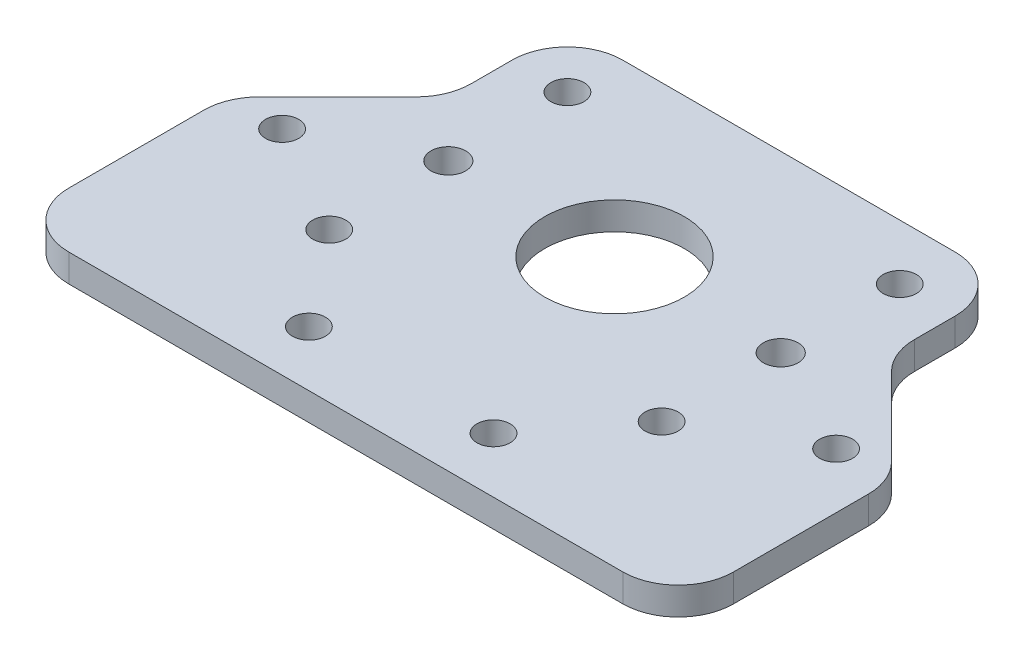
ISO-10303-21;
HEADER;
FILE_DESCRIPTION(('STEP AP214'),'2;1');
FILE_NAME('part.step','',(''),(''),'','','');
FILE_SCHEMA(('AUTOMOTIVE_DESIGN { 1 0 10303 214 1 1 1 1 }'));
ENDSEC;
DATA;
#1=APPLICATION_CONTEXT('core data for automotive mechanical design processes');
#2=APPLICATION_PROTOCOL_DEFINITION('international standard','automotive_design',2000,#1);
#3=PRODUCT_CONTEXT('',#1,'mechanical');
#4=PRODUCT('Part','Part','',(#3));
#5=PRODUCT_RELATED_PRODUCT_CATEGORY('part','',(#4));
#6=PRODUCT_DEFINITION_FORMATION('','',#4);
#7=PRODUCT_DEFINITION_CONTEXT('part definition',#1,'design');
#8=PRODUCT_DEFINITION('design','',#6,#7);
#9=PRODUCT_DEFINITION_SHAPE('','',#8);
#10=(LENGTH_UNIT() NAMED_UNIT(*) SI_UNIT(.MILLI.,.METRE.));
#11=(NAMED_UNIT(*) PLANE_ANGLE_UNIT() SI_UNIT($,.RADIAN.));
#12=(NAMED_UNIT(*) SI_UNIT($,.STERADIAN.) SOLID_ANGLE_UNIT());
#13=UNCERTAINTY_MEASURE_WITH_UNIT(LENGTH_MEASURE(1.E-05),#10,'distance_accuracy_value','');
#14=(GEOMETRIC_REPRESENTATION_CONTEXT(3) GLOBAL_UNCERTAINTY_ASSIGNED_CONTEXT((#13)) GLOBAL_UNIT_ASSIGNED_CONTEXT((#10,
#11,#12)) REPRESENTATION_CONTEXT('',''));
#15=CARTESIAN_POINT('',(0.,0.,0.));
#16=DIRECTION('',(0.,0.,1.));
#17=DIRECTION('',(1.,0.,0.));
#18=AXIS2_PLACEMENT_3D('',#15,#16,#17);
#19=CARTESIAN_POINT('',(0.,3.175,-50.8));
#20=DIRECTION('',(0.,-1.,0.));
#21=DIRECTION('',(0.,0.,-1.));
#22=AXIS2_PLACEMENT_3D('',#19,#20,#21);
#23=PLANE('',#22);
#24=CARTESIAN_POINT('',(6.34999999999999,3.175,-24.45004));
#25=DIRECTION('',(0.,-1.,0.));
#26=DIRECTION('',(0.,0.,-1.));
#27=AXIS2_PLACEMENT_3D('',#24,#25,#26);
#28=CIRCLE('',#27,1.89865);
#29=CARTESIAN_POINT('',(6.34999999999999,3.175,-26.34869));
#30=VERTEX_POINT('',#29);
#31=EDGE_CURVE('E188',#30,#30,#28,.T.);
#32=ORIENTED_EDGE('',*,*,#31,.T.);
#33=EDGE_LOOP('',(#32));
#34=FACE_BOUND('',#33,.T.);
#35=CARTESIAN_POINT('',(27.5166666666667,3.175,-6.35));
#36=DIRECTION('',(0.,-1.,0.));
#37=DIRECTION('',(0.,0.,-1.));
#38=AXIS2_PLACEMENT_3D('',#35,#36,#37);
#39=CIRCLE('',#38,1.89865);
#40=CARTESIAN_POINT('',(27.5166666666667,3.175,-8.24865));
#41=VERTEX_POINT('',#40);
#42=EDGE_CURVE('E195',#41,#41,#39,.T.);
#43=ORIENTED_EDGE('',*,*,#42,.T.);
#44=EDGE_LOOP('',(#43));
#45=FACE_BOUND('',#44,.T.);
#46=CARTESIAN_POINT('',(48.6833333333333,3.175,-6.35));
#47=DIRECTION('',(0.,-1.,0.));
#48=DIRECTION('',(0.,0.,-1.));
#49=AXIS2_PLACEMENT_3D('',#46,#47,#48);
#50=CIRCLE('',#49,1.89865);
#51=CARTESIAN_POINT('',(48.6833333333333,3.175,-8.24865));
#52=VERTEX_POINT('',#51);
#53=EDGE_CURVE('E201',#52,#52,#50,.T.);
#54=ORIENTED_EDGE('',*,*,#53,.T.);
#55=EDGE_LOOP('',(#54));
#56=FACE_BOUND('',#55,.T.);
#57=CARTESIAN_POINT('',(69.85,3.175,-24.45004));
#58=DIRECTION('',(0.,-1.,0.));
#59=DIRECTION('',(0.,0.,-1.));
#60=AXIS2_PLACEMENT_3D('',#57,#58,#59);
#61=CIRCLE('',#60,1.89865000000001);
#62=CARTESIAN_POINT('',(69.85,3.175,-26.34869));
#63=VERTEX_POINT('',#62);
#64=EDGE_CURVE('E207',#63,#63,#61,.T.);
#65=ORIENTED_EDGE('',*,*,#64,.T.);
#66=EDGE_LOOP('',(#65));
#67=FACE_BOUND('',#66,.T.);
#68=CARTESIAN_POINT('',(57.15,3.175,-17.15));
#69=DIRECTION('',(0.,-1.,0.));
#70=DIRECTION('',(0.,0.,-1.));
#71=AXIS2_PLACEMENT_3D('',#68,#69,#70);
#72=CIRCLE('',#71,1.89865);
#73=CARTESIAN_POINT('',(57.15,3.175,-19.04865));
#74=VERTEX_POINT('',#73);
#75=EDGE_CURVE('E213',#74,#74,#72,.T.);
#76=ORIENTED_EDGE('',*,*,#75,.T.);
#77=EDGE_LOOP('',(#76));
#78=FACE_BOUND('',#77,.T.);
#79=CARTESIAN_POINT('',(19.05,3.175,-17.15));
#80=DIRECTION('',(0.,-1.,0.));
#81=DIRECTION('',(0.,0.,-1.));
#82=AXIS2_PLACEMENT_3D('',#79,#80,#81);
#83=CIRCLE('',#82,1.89865);
#84=CARTESIAN_POINT('',(19.05,3.175,-19.04865));
#85=VERTEX_POINT('',#84);
#86=EDGE_CURVE('E219',#85,#85,#83,.T.);
#87=ORIENTED_EDGE('',*,*,#86,.T.);
#88=EDGE_LOOP('',(#87));
#89=FACE_BOUND('',#88,.T.);
#90=CARTESIAN_POINT('',(19.05,3.175,-44.45));
#91=DIRECTION('',(0.,-1.,0.));
#92=DIRECTION('',(0.,0.,-1.));
#93=AXIS2_PLACEMENT_3D('',#90,#91,#92);
#94=CIRCLE('',#93,1.89865);
#95=CARTESIAN_POINT('',(19.05,3.175,-46.34865));
#96=VERTEX_POINT('',#95);
#97=EDGE_CURVE('E225',#96,#96,#94,.T.);
#98=ORIENTED_EDGE('',*,*,#97,.T.);
#99=EDGE_LOOP('',(#98));
#100=FACE_BOUND('',#99,.T.);
#101=CARTESIAN_POINT('',(57.15,3.175,-44.45));
#102=DIRECTION('',(0.,-1.,0.));
#103=DIRECTION('',(0.,0.,-1.));
#104=AXIS2_PLACEMENT_3D('',#101,#102,#103);
#105=CIRCLE('',#104,1.89865);
#106=CARTESIAN_POINT('',(57.15,3.175,-46.34865));
#107=VERTEX_POINT('',#106);
#108=EDGE_CURVE('E231',#107,#107,#105,.T.);
#109=ORIENTED_EDGE('',*,*,#108,.T.);
#110=EDGE_LOOP('',(#109));
#111=FACE_BOUND('',#110,.T.);
#112=CARTESIAN_POINT('',(57.15,3.175,-30.8));
#113=DIRECTION('',(0.,1.,0.));
#114=DIRECTION('',(0.,0.,-1.));
#115=AXIS2_PLACEMENT_3D('',#112,#113,#114);
#116=CIRCLE('',#115,1.9939);
#117=CARTESIAN_POINT('',(57.15,3.175,-32.7939));
#118=VERTEX_POINT('',#117);
#119=EDGE_CURVE('E234',#118,#118,#116,.T.);
#120=ORIENTED_EDGE('',*,*,#119,.F.);
#121=EDGE_LOOP('',(#120));
#122=FACE_BOUND('',#121,.T.);
#123=CARTESIAN_POINT('',(19.05,3.175,-30.8));
#124=DIRECTION('',(0.,1.,0.));
#125=DIRECTION('',(0.,0.,1.));
#126=AXIS2_PLACEMENT_3D('',#123,#124,#125);
#127=CIRCLE('',#126,1.9939);
#128=CARTESIAN_POINT('',(19.05,3.175,-28.8061));
#129=VERTEX_POINT('',#128);
#130=EDGE_CURVE('E240',#129,#129,#127,.T.);
#131=ORIENTED_EDGE('',*,*,#130,.F.);
#132=EDGE_LOOP('',(#131));
#133=FACE_BOUND('',#132,.T.);
#134=DIRECTION('',(0.707106781186549,0.,-0.707106781186546));
#135=VECTOR('',#134,1.);
#136=CARTESIAN_POINT('',(12.7,3.175,-37.15));
#137=LINE('',#136,#135);
#138=CARTESIAN_POINT('',(1.85987193946543,3.175,-26.3098719394655));
#139=VERTEX_POINT('',#138);
#140=CARTESIAN_POINT('',(10.8401280605346,3.175,-35.2901280605346));
#141=VERTEX_POINT('',#140);
#142=EDGE_CURVE('E166',#139,#141,#137,.T.);
#143=ORIENTED_EDGE('',*,*,#142,.F.);
#144=CARTESIAN_POINT('',(6.35,3.175,-21.8197438789309));
#145=DIRECTION('',(0.,-1.,0.));
#146=DIRECTION('',(0.,0.,-1.));
#147=AXIS2_PLACEMENT_3D('',#144,#145,#146);
#148=CIRCLE('',#147,6.35);
#149=CARTESIAN_POINT('',(0.,3.175,-21.8197438789309));
#150=VERTEX_POINT('',#149);
#151=EDGE_CURVE('E149',#139,#150,#148,.F.);
#152=ORIENTED_EDGE('',*,*,#151,.T.);
#153=DIRECTION('',(0.,0.,1.));
#154=VECTOR('',#153,1.);
#155=CARTESIAN_POINT('',(0.,3.175,0.));
#156=LINE('',#155,#154);
#157=CARTESIAN_POINT('',(0.,3.175,-6.35));
#158=VERTEX_POINT('',#157);
#159=EDGE_CURVE('E255',#150,#158,#156,.T.);
#160=ORIENTED_EDGE('',*,*,#159,.T.);
#161=CARTESIAN_POINT('',(6.35,3.175,-6.35));
#162=DIRECTION('',(0.,-1.,0.));
#163=DIRECTION('',(0.,0.,-1.));
#164=AXIS2_PLACEMENT_3D('',#161,#162,#163);
#165=CIRCLE('',#164,6.35);
#166=CARTESIAN_POINT('',(6.35,3.175,0.));
#167=VERTEX_POINT('',#166);
#168=EDGE_CURVE('E170',#158,#167,#165,.F.);
#169=ORIENTED_EDGE('',*,*,#168,.T.);
#170=DIRECTION('',(1.,0.,0.));
#171=VECTOR('',#170,1.);
#172=CARTESIAN_POINT('',(0.,3.175,0.));
#173=LINE('',#172,#171);
#174=CARTESIAN_POINT('',(69.85,3.175,0.));
#175=VERTEX_POINT('',#174);
#176=EDGE_CURVE('E257',#167,#175,#173,.T.);
#177=ORIENTED_EDGE('',*,*,#176,.T.);
#178=CARTESIAN_POINT('',(69.85,3.175,-6.35));
#179=DIRECTION('',(0.,-1.,0.));
#180=DIRECTION('',(0.,0.,-1.));
#181=AXIS2_PLACEMENT_3D('',#178,#179,#180);
#182=CIRCLE('',#181,6.35);
#183=CARTESIAN_POINT('',(76.2,3.175,-6.35));
#184=VERTEX_POINT('',#183);
#185=EDGE_CURVE('E279',#175,#184,#182,.F.);
#186=ORIENTED_EDGE('',*,*,#185,.T.);
#187=DIRECTION('',(0.,0.,-1.));
#188=VECTOR('',#187,1.);
#189=CARTESIAN_POINT('',(76.2,3.175,-50.8));
#190=LINE('',#189,#188);
#191=CARTESIAN_POINT('',(76.2,3.175,-21.8197438789309));
#192=VERTEX_POINT('',#191);
#193=EDGE_CURVE('E261',#184,#192,#190,.T.);
#194=ORIENTED_EDGE('',*,*,#193,.T.);
#195=CARTESIAN_POINT('',(69.85,3.175,-21.8197438789309));
#196=DIRECTION('',(0.,-1.,0.));
#197=DIRECTION('',(0.,0.,-1.));
#198=AXIS2_PLACEMENT_3D('',#195,#196,#197);
#199=CIRCLE('',#198,6.35);
#200=CARTESIAN_POINT('',(74.3401280605346,3.175,-26.3098719394655));
#201=VERTEX_POINT('',#200);
#202=EDGE_CURVE('E160',#192,#201,#199,.F.);
#203=ORIENTED_EDGE('',*,*,#202,.T.);
#204=DIRECTION('',(0.707106781186549,0.,0.707106781186546));
#205=VECTOR('',#204,1.);
#206=CARTESIAN_POINT('',(76.2,3.175,-24.4500000000001));
#207=LINE('',#206,#205);
#208=CARTESIAN_POINT('',(65.3598719394654,3.175,-35.2901280605346));
#209=VERTEX_POINT('',#208);
#210=EDGE_CURVE('E335',#209,#201,#207,.T.);
#211=ORIENTED_EDGE('',*,*,#210,.F.);
#212=CARTESIAN_POINT('',(69.85,3.175,-39.7802561210692));
#213=DIRECTION('',(0.,-1.,0.));
#214=DIRECTION('',(0.,0.,-1.));
#215=AXIS2_PLACEMENT_3D('',#212,#213,#214);
#216=CIRCLE('',#215,6.35);
#217=CARTESIAN_POINT('',(63.5,3.175,-39.7802561210692));
#218=VERTEX_POINT('',#217);
#219=EDGE_CURVE('E43',#209,#218,#216,.T.);
#220=ORIENTED_EDGE('',*,*,#219,.T.);
#221=DIRECTION('',(0.,0.,1.));
#222=VECTOR('',#221,1.);
#223=CARTESIAN_POINT('',(63.5,3.175,-50.8));
#224=LINE('',#223,#222);
#225=CARTESIAN_POINT('',(63.5,3.175,-44.45));
#226=VERTEX_POINT('',#225);
#227=EDGE_CURVE('E333',#226,#218,#224,.T.);
#228=ORIENTED_EDGE('',*,*,#227,.F.);
#229=CARTESIAN_POINT('',(57.15,3.175,-44.45));
#230=DIRECTION('',(0.,-1.,0.));
#231=DIRECTION('',(0.,0.,-1.));
#232=AXIS2_PLACEMENT_3D('',#229,#230,#231);
#233=CIRCLE('',#232,6.35);
#234=CARTESIAN_POINT('',(57.15,3.175,-50.8));
#235=VERTEX_POINT('',#234);
#236=EDGE_CURVE('E283',#226,#235,#233,.F.);
#237=ORIENTED_EDGE('',*,*,#236,.T.);
#238=DIRECTION('',(-1.,0.,0.));
#239=VECTOR('',#238,1.);
#240=CARTESIAN_POINT('',(38.1,3.175,-50.8));
#241=LINE('',#240,#239);
#242=CARTESIAN_POINT('',(19.05,3.175,-50.8));
#243=VERTEX_POINT('',#242);
#244=EDGE_CURVE('E264',#235,#243,#241,.T.);
#245=ORIENTED_EDGE('',*,*,#244,.T.);
#246=CARTESIAN_POINT('',(19.05,3.175,-44.45));
#247=DIRECTION('',(0.,-1.,0.));
#248=DIRECTION('',(0.,0.,-1.));
#249=AXIS2_PLACEMENT_3D('',#246,#247,#248);
#250=CIRCLE('',#249,6.35);
#251=CARTESIAN_POINT('',(12.7,3.175,-44.45));
#252=VERTEX_POINT('',#251);
#253=EDGE_CURVE('E281',#243,#252,#250,.F.);
#254=ORIENTED_EDGE('',*,*,#253,.T.);
#255=DIRECTION('',(0.,0.,-1.));
#256=VECTOR('',#255,1.);
#257=CARTESIAN_POINT('',(12.7,3.175,-50.8));
#258=LINE('',#257,#256);
#259=CARTESIAN_POINT('',(12.7,3.175,-39.7802561210692));
#260=VERTEX_POINT('',#259);
#261=EDGE_CURVE('E176',#260,#252,#258,.T.);
#262=ORIENTED_EDGE('',*,*,#261,.F.);
#263=CARTESIAN_POINT('',(6.35,3.175,-39.7802561210692));
#264=DIRECTION('',(0.,-1.,0.));
#265=DIRECTION('',(0.,0.,-1.));
#266=AXIS2_PLACEMENT_3D('',#263,#264,#265);
#267=CIRCLE('',#266,6.35);
#268=EDGE_CURVE('E175',#260,#141,#267,.T.);
#269=ORIENTED_EDGE('',*,*,#268,.T.);
#270=EDGE_LOOP('',(#143,#152,#160,#169,#177,#186,#194,#203,#211,#220,#228,#237,#245,#254,#262,#269));
#271=FACE_BOUND('',#270,.T.);
#272=CARTESIAN_POINT('',(38.1,3.175,-30.8));
#273=DIRECTION('',(0.,1.,0.));
#274=DIRECTION('',(0.,0.,1.));
#275=AXIS2_PLACEMENT_3D('',#272,#273,#274);
#276=CIRCLE('',#275,8.);
#277=CARTESIAN_POINT('',(38.1,3.175,-22.8));
#278=VERTEX_POINT('',#277);
#279=EDGE_CURVE('E249',#278,#278,#276,.T.);
#280=ORIENTED_EDGE('',*,*,#279,.F.);
#281=EDGE_LOOP('',(#280));
#282=FACE_BOUND('',#281,.T.);
#283=ADVANCED_FACE('F35',(#34,#45,#56,#67,#78,#89,#100,#111,#122,#133,#271,#282),#23,.F.);
#284=CARTESIAN_POINT('',(0.,0.,-50.8));
#285=DIRECTION('',(0.,-1.,0.));
#286=DIRECTION('',(0.,0.,-1.));
#287=AXIS2_PLACEMENT_3D('',#284,#285,#286);
#288=PLANE('',#287);
#289=DIRECTION('',(0.,0.,1.));
#290=VECTOR('',#289,1.);
#291=CARTESIAN_POINT('',(0.,0.,0.));
#292=LINE('',#291,#290);
#293=CARTESIAN_POINT('',(0.,0.,-21.8197438789309));
#294=VERTEX_POINT('',#293);
#295=CARTESIAN_POINT('',(0.,0.,-6.35));
#296=VERTEX_POINT('',#295);
#297=EDGE_CURVE('E252',#294,#296,#292,.T.);
#298=ORIENTED_EDGE('',*,*,#297,.F.);
#299=CARTESIAN_POINT('',(6.35,0.,-21.8197438789309));
#300=DIRECTION('',(0.,-1.,0.));
#301=DIRECTION('',(0.,0.,-1.));
#302=AXIS2_PLACEMENT_3D('',#299,#300,#301);
#303=CIRCLE('',#302,6.35);
#304=CARTESIAN_POINT('',(1.85987193946543,0.,-26.3098719394655));
#305=VERTEX_POINT('',#304);
#306=EDGE_CURVE('E297',#294,#305,#303,.T.);
#307=ORIENTED_EDGE('',*,*,#306,.T.);
#308=DIRECTION('',(0.707106781186549,0.,-0.707106781186546));
#309=VECTOR('',#308,1.);
#310=CARTESIAN_POINT('',(12.7,0.,-37.15));
#311=LINE('',#310,#309);
#312=CARTESIAN_POINT('',(10.8401280605346,0.,-35.2901280605346));
#313=VERTEX_POINT('',#312);
#314=EDGE_CURVE('E169',#305,#313,#311,.T.);
#315=ORIENTED_EDGE('',*,*,#314,.T.);
#316=CARTESIAN_POINT('',(6.35,0.,-39.7802561210692));
#317=DIRECTION('',(0.,-1.,0.));
#318=DIRECTION('',(0.,0.,-1.));
#319=AXIS2_PLACEMENT_3D('',#316,#317,#318);
#320=CIRCLE('',#319,6.35);
#321=CARTESIAN_POINT('',(12.7,0.,-39.7802561210692));
#322=VERTEX_POINT('',#321);
#323=EDGE_CURVE('E330',#313,#322,#320,.F.);
#324=ORIENTED_EDGE('',*,*,#323,.T.);
#325=DIRECTION('',(0.,0.,-1.));
#326=VECTOR('',#325,1.);
#327=CARTESIAN_POINT('',(12.7,0.,-50.8));
#328=LINE('',#327,#326);
#329=CARTESIAN_POINT('',(12.7,0.,-44.45));
#330=VERTEX_POINT('',#329);
#331=EDGE_CURVE('E185',#322,#330,#328,.T.);
#332=ORIENTED_EDGE('',*,*,#331,.T.);
#333=CARTESIAN_POINT('',(19.05,0.,-44.45));
#334=DIRECTION('',(0.,-1.,0.));
#335=DIRECTION('',(0.,0.,-1.));
#336=AXIS2_PLACEMENT_3D('',#333,#334,#335);
#337=CIRCLE('',#336,6.35);
#338=CARTESIAN_POINT('',(19.05,0.,-50.8));
#339=VERTEX_POINT('',#338);
#340=EDGE_CURVE('E292',#330,#339,#337,.T.);
#341=ORIENTED_EDGE('',*,*,#340,.T.);
#342=DIRECTION('',(-1.,0.,0.));
#343=VECTOR('',#342,1.);
#344=CARTESIAN_POINT('',(0.,0.,-50.8));
#345=LINE('',#344,#343);
#346=CARTESIAN_POINT('',(57.15,0.,-50.8));
#347=VERTEX_POINT('',#346);
#348=EDGE_CURVE('E258',#347,#339,#345,.T.);
#349=ORIENTED_EDGE('',*,*,#348,.F.);
#350=CARTESIAN_POINT('',(57.15,0.,-44.45));
#351=DIRECTION('',(0.,-1.,0.));
#352=DIRECTION('',(0.,0.,-1.));
#353=AXIS2_PLACEMENT_3D('',#350,#351,#352);
#354=CIRCLE('',#353,6.35);
#355=CARTESIAN_POINT('',(63.5,0.,-44.45));
#356=VERTEX_POINT('',#355);
#357=EDGE_CURVE('E57',#347,#356,#354,.T.);
#358=ORIENTED_EDGE('',*,*,#357,.T.);
#359=DIRECTION('',(0.,0.,1.));
#360=VECTOR('',#359,1.);
#361=CARTESIAN_POINT('',(63.5,0.,-50.8));
#362=LINE('',#361,#360);
#363=CARTESIAN_POINT('',(63.5,0.,-39.7802561210692));
#364=VERTEX_POINT('',#363);
#365=EDGE_CURVE('E182',#356,#364,#362,.T.);
#366=ORIENTED_EDGE('',*,*,#365,.T.);
#367=CARTESIAN_POINT('',(69.85,0.,-39.7802561210692));
#368=DIRECTION('',(0.,-1.,0.));
#369=DIRECTION('',(0.,0.,-1.));
#370=AXIS2_PLACEMENT_3D('',#367,#368,#369);
#371=CIRCLE('',#370,6.35);
#372=CARTESIAN_POINT('',(65.3598719394654,0.,-35.2901280605346));
#373=VERTEX_POINT('',#372);
#374=EDGE_CURVE('E11',#364,#373,#371,.F.);
#375=ORIENTED_EDGE('',*,*,#374,.T.);
#376=DIRECTION('',(0.707106781186549,0.,0.707106781186546));
#377=VECTOR('',#376,1.);
#378=CARTESIAN_POINT('',(76.2,0.,-24.4500000000001));
#379=LINE('',#378,#377);
#380=CARTESIAN_POINT('',(74.3401280605346,0.,-26.3098719394655));
#381=VERTEX_POINT('',#380);
#382=EDGE_CURVE('E177',#373,#381,#379,.T.);
#383=ORIENTED_EDGE('',*,*,#382,.T.);
#384=CARTESIAN_POINT('',(69.85,0.,-21.8197438789309));
#385=DIRECTION('',(0.,-1.,0.));
#386=DIRECTION('',(0.,0.,-1.));
#387=AXIS2_PLACEMENT_3D('',#384,#385,#386);
#388=CIRCLE('',#387,6.35);
#389=CARTESIAN_POINT('',(76.2,0.,-21.8197438789309));
#390=VERTEX_POINT('',#389);
#391=EDGE_CURVE('E295',#381,#390,#388,.T.);
#392=ORIENTED_EDGE('',*,*,#391,.T.);
#393=DIRECTION('',(0.,0.,-1.));
#394=VECTOR('',#393,1.);
#395=CARTESIAN_POINT('',(76.2,0.,-50.8));
#396=LINE('',#395,#394);
#397=CARTESIAN_POINT('',(76.2,0.,-6.35));
#398=VERTEX_POINT('',#397);
#399=EDGE_CURVE('E272',#398,#390,#396,.T.);
#400=ORIENTED_EDGE('',*,*,#399,.F.);
#401=CARTESIAN_POINT('',(69.85,0.,-6.35));
#402=DIRECTION('',(0.,-1.,0.));
#403=DIRECTION('',(0.,0.,-1.));
#404=AXIS2_PLACEMENT_3D('',#401,#402,#403);
#405=CIRCLE('',#404,6.35);
#406=CARTESIAN_POINT('',(69.85,0.,0.));
#407=VERTEX_POINT('',#406);
#408=EDGE_CURVE('E290',#398,#407,#405,.T.);
#409=ORIENTED_EDGE('',*,*,#408,.T.);
#410=DIRECTION('',(1.,0.,0.));
#411=VECTOR('',#410,1.);
#412=CARTESIAN_POINT('',(0.,0.,0.));
#413=LINE('',#412,#411);
#414=CARTESIAN_POINT('',(6.35,0.,0.));
#415=VERTEX_POINT('',#414);
#416=EDGE_CURVE('E269',#415,#407,#413,.T.);
#417=ORIENTED_EDGE('',*,*,#416,.F.);
#418=CARTESIAN_POINT('',(6.35,0.,-6.35));
#419=DIRECTION('',(0.,-1.,0.));
#420=DIRECTION('',(0.,0.,-1.));
#421=AXIS2_PLACEMENT_3D('',#418,#419,#420);
#422=CIRCLE('',#421,6.35);
#423=EDGE_CURVE('E288',#415,#296,#422,.T.);
#424=ORIENTED_EDGE('',*,*,#423,.T.);
#425=EDGE_LOOP('',(#298,#307,#315,#324,#332,#341,#349,#358,#366,#375,#383,#392,#400,#409,#417,#424));
#426=FACE_BOUND('',#425,.T.);
#427=CARTESIAN_POINT('',(6.34999999999999,0.,-24.45004));
#428=DIRECTION('',(0.,-1.,0.));
#429=DIRECTION('',(0.,0.,-1.));
#430=AXIS2_PLACEMENT_3D('',#427,#428,#429);
#431=CIRCLE('',#430,1.89865);
#432=CARTESIAN_POINT('',(6.34999999999999,0.,-26.34869));
#433=VERTEX_POINT('',#432);
#434=EDGE_CURVE('E192',#433,#433,#431,.T.);
#435=ORIENTED_EDGE('',*,*,#434,.F.);
#436=EDGE_LOOP('',(#435));
#437=FACE_BOUND('',#436,.T.);
#438=CARTESIAN_POINT('',(27.5166666666667,0.,-6.35));
#439=DIRECTION('',(0.,-1.,0.));
#440=DIRECTION('',(0.,0.,-1.));
#441=AXIS2_PLACEMENT_3D('',#438,#439,#440);
#442=CIRCLE('',#441,1.89865);
#443=CARTESIAN_POINT('',(27.5166666666667,0.,-8.24865));
#444=VERTEX_POINT('',#443);
#445=EDGE_CURVE('E191',#444,#444,#442,.T.);
#446=ORIENTED_EDGE('',*,*,#445,.F.);
#447=EDGE_LOOP('',(#446));
#448=FACE_BOUND('',#447,.T.);
#449=CARTESIAN_POINT('',(48.6833333333333,0.,-6.35));
#450=DIRECTION('',(0.,-1.,0.));
#451=DIRECTION('',(0.,0.,-1.));
#452=AXIS2_PLACEMENT_3D('',#449,#450,#451);
#453=CIRCLE('',#452,1.89865);
#454=CARTESIAN_POINT('',(48.6833333333333,0.,-8.24865));
#455=VERTEX_POINT('',#454);
#456=EDGE_CURVE('E198',#455,#455,#453,.T.);
#457=ORIENTED_EDGE('',*,*,#456,.F.);
#458=EDGE_LOOP('',(#457));
#459=FACE_BOUND('',#458,.T.);
#460=CARTESIAN_POINT('',(69.85,0.,-24.45004));
#461=DIRECTION('',(0.,-1.,0.));
#462=DIRECTION('',(0.,0.,-1.));
#463=AXIS2_PLACEMENT_3D('',#460,#461,#462);
#464=CIRCLE('',#463,1.89865000000001);
#465=CARTESIAN_POINT('',(69.85,0.,-26.34869));
#466=VERTEX_POINT('',#465);
#467=EDGE_CURVE('E204',#466,#466,#464,.T.);
#468=ORIENTED_EDGE('',*,*,#467,.F.);
#469=EDGE_LOOP('',(#468));
#470=FACE_BOUND('',#469,.T.);
#471=CARTESIAN_POINT('',(57.15,0.,-17.15));
#472=DIRECTION('',(0.,-1.,0.));
#473=DIRECTION('',(0.,0.,-1.));
#474=AXIS2_PLACEMENT_3D('',#471,#472,#473);
#475=CIRCLE('',#474,1.89865);
#476=CARTESIAN_POINT('',(57.15,0.,-19.04865));
#477=VERTEX_POINT('',#476);
#478=EDGE_CURVE('E210',#477,#477,#475,.T.);
#479=ORIENTED_EDGE('',*,*,#478,.F.);
#480=EDGE_LOOP('',(#479));
#481=FACE_BOUND('',#480,.T.);
#482=CARTESIAN_POINT('',(19.05,0.,-17.15));
#483=DIRECTION('',(0.,-1.,0.));
#484=DIRECTION('',(0.,0.,-1.));
#485=AXIS2_PLACEMENT_3D('',#482,#483,#484);
#486=CIRCLE('',#485,1.89865);
#487=CARTESIAN_POINT('',(19.05,0.,-19.04865));
#488=VERTEX_POINT('',#487);
#489=EDGE_CURVE('E216',#488,#488,#486,.T.);
#490=ORIENTED_EDGE('',*,*,#489,.F.);
#491=EDGE_LOOP('',(#490));
#492=FACE_BOUND('',#491,.T.);
#493=CARTESIAN_POINT('',(19.05,0.,-44.45));
#494=DIRECTION('',(0.,-1.,0.));
#495=DIRECTION('',(0.,0.,-1.));
#496=AXIS2_PLACEMENT_3D('',#493,#494,#495);
#497=CIRCLE('',#496,1.89865);
#498=CARTESIAN_POINT('',(19.05,0.,-46.34865));
#499=VERTEX_POINT('',#498);
#500=EDGE_CURVE('E222',#499,#499,#497,.T.);
#501=ORIENTED_EDGE('',*,*,#500,.F.);
#502=EDGE_LOOP('',(#501));
#503=FACE_BOUND('',#502,.T.);
#504=CARTESIAN_POINT('',(57.15,0.,-44.45));
#505=DIRECTION('',(0.,-1.,0.));
#506=DIRECTION('',(0.,0.,-1.));
#507=AXIS2_PLACEMENT_3D('',#504,#505,#506);
#508=CIRCLE('',#507,1.89865);
#509=CARTESIAN_POINT('',(57.15,0.,-46.34865));
#510=VERTEX_POINT('',#509);
#511=EDGE_CURVE('E228',#510,#510,#508,.T.);
#512=ORIENTED_EDGE('',*,*,#511,.F.);
#513=EDGE_LOOP('',(#512));
#514=FACE_BOUND('',#513,.T.);
#515=CARTESIAN_POINT('',(57.15,0.,-30.8));
#516=DIRECTION('',(0.,1.,0.));
#517=DIRECTION('',(0.,0.,-1.));
#518=AXIS2_PLACEMENT_3D('',#515,#516,#517);
#519=CIRCLE('',#518,1.9939);
#520=CARTESIAN_POINT('',(57.15,0.,-32.7939));
#521=VERTEX_POINT('',#520);
#522=EDGE_CURVE('E237',#521,#521,#519,.T.);
#523=ORIENTED_EDGE('',*,*,#522,.T.);
#524=EDGE_LOOP('',(#523));
#525=FACE_BOUND('',#524,.T.);
#526=CARTESIAN_POINT('',(19.05,0.,-30.8));
#527=DIRECTION('',(0.,1.,0.));
#528=DIRECTION('',(0.,0.,1.));
#529=AXIS2_PLACEMENT_3D('',#526,#527,#528);
#530=CIRCLE('',#529,1.9939);
#531=CARTESIAN_POINT('',(19.05,0.,-28.8061));
#532=VERTEX_POINT('',#531);
#533=EDGE_CURVE('E243',#532,#532,#530,.T.);
#534=ORIENTED_EDGE('',*,*,#533,.T.);
#535=EDGE_LOOP('',(#534));
#536=FACE_BOUND('',#535,.T.);
#537=CARTESIAN_POINT('',(38.1,0.,-30.8));
#538=DIRECTION('',(0.,1.,0.));
#539=DIRECTION('',(0.,0.,1.));
#540=AXIS2_PLACEMENT_3D('',#537,#538,#539);
#541=CIRCLE('',#540,8.);
#542=CARTESIAN_POINT('',(38.1,0.,-22.8));
#543=VERTEX_POINT('',#542);
#544=EDGE_CURVE('E246',#543,#543,#541,.T.);
#545=ORIENTED_EDGE('',*,*,#544,.T.);
#546=EDGE_LOOP('',(#545));
#547=FACE_BOUND('',#546,.T.);
#548=ADVANCED_FACE('F345',(#426,#437,#448,#459,#470,#481,#492,#503,#514,#525,#536,#547),#288,.T.);
#549=CARTESIAN_POINT('',(0.,3.175,0.));
#550=DIRECTION('',(1.,0.,0.));
#551=DIRECTION('',(0.,0.,-1.));
#552=AXIS2_PLACEMENT_3D('',#549,#550,#551);
#553=PLANE('',#552);
#554=ORIENTED_EDGE('',*,*,#159,.F.);
#555=DIRECTION('',(0.,1.,0.));
#556=VECTOR('',#555,1.);
#557=CARTESIAN_POINT('',(0.,3.175,-21.8197438789309));
#558=LINE('',#557,#556);
#559=EDGE_CURVE('E154',#150,#294,#558,.F.);
#560=ORIENTED_EDGE('',*,*,#559,.T.);
#561=ORIENTED_EDGE('',*,*,#297,.T.);
#562=DIRECTION('',(0.,-1.,0.));
#563=VECTOR('',#562,1.);
#564=CARTESIAN_POINT('',(0.,3.175,-6.35));
#565=LINE('',#564,#563);
#566=EDGE_CURVE('E159',#296,#158,#565,.F.);
#567=ORIENTED_EDGE('',*,*,#566,.T.);
#568=EDGE_LOOP('',(#554,#560,#561,#567));
#569=FACE_BOUND('',#568,.T.);
#570=ADVANCED_FACE('F372',(#569),#553,.F.);
#571=CARTESIAN_POINT('',(0.,3.175,0.));
#572=DIRECTION('',(0.,0.,-1.));
#573=DIRECTION('',(-1.,0.,0.));
#574=AXIS2_PLACEMENT_3D('',#571,#572,#573);
#575=PLANE('',#574);
#576=ORIENTED_EDGE('',*,*,#416,.T.);
#577=DIRECTION('',(0.,-1.,0.));
#578=VECTOR('',#577,1.);
#579=CARTESIAN_POINT('',(69.85,3.175,0.));
#580=LINE('',#579,#578);
#581=EDGE_CURVE('E327',#407,#175,#580,.F.);
#582=ORIENTED_EDGE('',*,*,#581,.T.);
#583=ORIENTED_EDGE('',*,*,#176,.F.);
#584=DIRECTION('',(0.,-1.,0.));
#585=VECTOR('',#584,1.);
#586=CARTESIAN_POINT('',(6.35,3.175,0.));
#587=LINE('',#586,#585);
#588=EDGE_CURVE('E324',#167,#415,#587,.T.);
#589=ORIENTED_EDGE('',*,*,#588,.T.);
#590=EDGE_LOOP('',(#576,#582,#583,#589));
#591=FACE_BOUND('',#590,.T.);
#592=ADVANCED_FACE('F365',(#591),#575,.F.);
#593=CARTESIAN_POINT('',(76.2,3.175,-50.8));
#594=DIRECTION('',(-1.,0.,0.));
#595=DIRECTION('',(0.,0.,1.));
#596=AXIS2_PLACEMENT_3D('',#593,#594,#595);
#597=PLANE('',#596);
#598=ORIENTED_EDGE('',*,*,#399,.T.);
#599=DIRECTION('',(0.,1.,0.));
#600=VECTOR('',#599,1.);
#601=CARTESIAN_POINT('',(76.2,3.175,-21.8197438789309));
#602=LINE('',#601,#600);
#603=EDGE_CURVE('E307',#390,#192,#602,.T.);
#604=ORIENTED_EDGE('',*,*,#603,.T.);
#605=ORIENTED_EDGE('',*,*,#193,.F.);
#606=DIRECTION('',(0.,-1.,0.));
#607=VECTOR('',#606,1.);
#608=CARTESIAN_POINT('',(76.2,3.175,-6.35));
#609=LINE('',#608,#607);
#610=EDGE_CURVE('E304',#184,#398,#609,.T.);
#611=ORIENTED_EDGE('',*,*,#610,.T.);
#612=EDGE_LOOP('',(#598,#604,#605,#611));
#613=FACE_BOUND('',#612,.T.);
#614=ADVANCED_FACE('F356',(#613),#597,.F.);
#615=CARTESIAN_POINT('',(0.,3.175,-50.8));
#616=DIRECTION('',(0.,0.,1.));
#617=DIRECTION('',(1.,0.,0.));
#618=AXIS2_PLACEMENT_3D('',#615,#616,#617);
#619=PLANE('',#618);
#620=ORIENTED_EDGE('',*,*,#244,.F.);
#621=DIRECTION('',(0.,1.,0.));
#622=VECTOR('',#621,1.);
#623=CARTESIAN_POINT('',(57.15,3.175,-50.8));
#624=LINE('',#623,#622);
#625=EDGE_CURVE('E322',#235,#347,#624,.F.);
#626=ORIENTED_EDGE('',*,*,#625,.T.);
#627=ORIENTED_EDGE('',*,*,#348,.T.);
#628=DIRECTION('',(0.,1.,0.));
#629=VECTOR('',#628,1.);
#630=CARTESIAN_POINT('',(19.05,3.175,-50.8));
#631=LINE('',#630,#629);
#632=EDGE_CURVE('E319',#339,#243,#631,.T.);
#633=ORIENTED_EDGE('',*,*,#632,.T.);
#634=EDGE_LOOP('',(#620,#626,#627,#633));
#635=FACE_BOUND('',#634,.T.);
#636=ADVANCED_FACE('F392',(#635),#619,.F.);
#637=CARTESIAN_POINT('',(38.1,3.175,-30.8));
#638=DIRECTION('',(0.,-1.,0.));
#639=DIRECTION('',(0.,0.,-1.));
#640=AXIS2_PLACEMENT_3D('',#637,#638,#639);
#641=CYLINDRICAL_SURFACE('',#640,8.);
#642=ORIENTED_EDGE('',*,*,#279,.T.);
#643=EDGE_LOOP('',(#642));
#644=FACE_BOUND('',#643,.T.);
#645=ORIENTED_EDGE('',*,*,#544,.F.);
#646=EDGE_LOOP('',(#645));
#647=FACE_BOUND('',#646,.T.);
#648=ADVANCED_FACE('F389',(#644,#647),#641,.F.);
#649=CARTESIAN_POINT('',(19.05,0.,-30.8));
#650=DIRECTION('',(0.,1.,0.));
#651=DIRECTION('',(0.,0.,1.));
#652=AXIS2_PLACEMENT_3D('',#649,#650,#651);
#653=CYLINDRICAL_SURFACE('',#652,1.9939);
#654=ORIENTED_EDGE('',*,*,#533,.F.);
#655=EDGE_LOOP('',(#654));
#656=FACE_BOUND('',#655,.T.);
#657=ORIENTED_EDGE('',*,*,#130,.T.);
#658=EDGE_LOOP('',(#657));
#659=FACE_BOUND('',#658,.T.);
#660=ADVANCED_FACE('F412',(#656,#659),#653,.F.);
#661=CARTESIAN_POINT('',(57.15,0.,-30.8));
#662=DIRECTION('',(0.,1.,0.));
#663=DIRECTION('',(0.,0.,1.));
#664=AXIS2_PLACEMENT_3D('',#661,#662,#663);
#665=CYLINDRICAL_SURFACE('',#664,1.9939);
#666=ORIENTED_EDGE('',*,*,#522,.F.);
#667=EDGE_LOOP('',(#666));
#668=FACE_BOUND('',#667,.T.);
#669=ORIENTED_EDGE('',*,*,#119,.T.);
#670=EDGE_LOOP('',(#669));
#671=FACE_BOUND('',#670,.T.);
#672=ADVANCED_FACE('F419',(#668,#671),#665,.F.);
#673=CARTESIAN_POINT('',(57.15,3.175,-44.45));
#674=DIRECTION('',(0.,-1.,0.));
#675=DIRECTION('',(0.,0.,-1.));
#676=AXIS2_PLACEMENT_3D('',#673,#674,#675);
#677=CYLINDRICAL_SURFACE('',#676,1.89865);
#678=ORIENTED_EDGE('',*,*,#108,.F.);
#679=EDGE_LOOP('',(#678));
#680=FACE_BOUND('',#679,.T.);
#681=ORIENTED_EDGE('',*,*,#511,.T.);
#682=EDGE_LOOP('',(#681));
#683=FACE_BOUND('',#682,.T.);
#684=ADVANCED_FACE('F426',(#680,#683),#677,.F.);
#685=CARTESIAN_POINT('',(19.05,3.175,-44.45));
#686=DIRECTION('',(0.,-1.,0.));
#687=DIRECTION('',(0.,0.,-1.));
#688=AXIS2_PLACEMENT_3D('',#685,#686,#687);
#689=CYLINDRICAL_SURFACE('',#688,1.89865);
#690=ORIENTED_EDGE('',*,*,#97,.F.);
#691=EDGE_LOOP('',(#690));
#692=FACE_BOUND('',#691,.T.);
#693=ORIENTED_EDGE('',*,*,#500,.T.);
#694=EDGE_LOOP('',(#693));
#695=FACE_BOUND('',#694,.T.);
#696=ADVANCED_FACE('F434',(#692,#695),#689,.F.);
#697=CARTESIAN_POINT('',(19.05,3.175,-17.15));
#698=DIRECTION('',(0.,-1.,0.));
#699=DIRECTION('',(0.,0.,-1.));
#700=AXIS2_PLACEMENT_3D('',#697,#698,#699);
#701=CYLINDRICAL_SURFACE('',#700,1.89865);
#702=ORIENTED_EDGE('',*,*,#86,.F.);
#703=EDGE_LOOP('',(#702));
#704=FACE_BOUND('',#703,.T.);
#705=ORIENTED_EDGE('',*,*,#489,.T.);
#706=EDGE_LOOP('',(#705));
#707=FACE_BOUND('',#706,.T.);
#708=ADVANCED_FACE('F442',(#704,#707),#701,.F.);
#709=CARTESIAN_POINT('',(57.15,3.175,-17.15));
#710=DIRECTION('',(0.,-1.,0.));
#711=DIRECTION('',(0.,0.,-1.));
#712=AXIS2_PLACEMENT_3D('',#709,#710,#711);
#713=CYLINDRICAL_SURFACE('',#712,1.89865);
#714=ORIENTED_EDGE('',*,*,#75,.F.);
#715=EDGE_LOOP('',(#714));
#716=FACE_BOUND('',#715,.T.);
#717=ORIENTED_EDGE('',*,*,#478,.T.);
#718=EDGE_LOOP('',(#717));
#719=FACE_BOUND('',#718,.T.);
#720=ADVANCED_FACE('F450',(#716,#719),#713,.F.);
#721=CARTESIAN_POINT('',(69.85,3.175,-24.45004));
#722=DIRECTION('',(0.,-1.,0.));
#723=DIRECTION('',(0.,0.,-1.));
#724=AXIS2_PLACEMENT_3D('',#721,#722,#723);
#725=CYLINDRICAL_SURFACE('',#724,1.89865000000001);
#726=ORIENTED_EDGE('',*,*,#64,.F.);
#727=EDGE_LOOP('',(#726));
#728=FACE_BOUND('',#727,.T.);
#729=ORIENTED_EDGE('',*,*,#467,.T.);
#730=EDGE_LOOP('',(#729));
#731=FACE_BOUND('',#730,.T.);
#732=ADVANCED_FACE('F458',(#728,#731),#725,.F.);
#733=CARTESIAN_POINT('',(48.6833333333333,3.175,-6.35));
#734=DIRECTION('',(0.,-1.,0.));
#735=DIRECTION('',(0.,0.,-1.));
#736=AXIS2_PLACEMENT_3D('',#733,#734,#735);
#737=CYLINDRICAL_SURFACE('',#736,1.89865);
#738=ORIENTED_EDGE('',*,*,#53,.F.);
#739=EDGE_LOOP('',(#738));
#740=FACE_BOUND('',#739,.T.);
#741=ORIENTED_EDGE('',*,*,#456,.T.);
#742=EDGE_LOOP('',(#741));
#743=FACE_BOUND('',#742,.T.);
#744=ADVANCED_FACE('F466',(#740,#743),#737,.F.);
#745=CARTESIAN_POINT('',(27.5166666666667,3.175,-6.35));
#746=DIRECTION('',(0.,-1.,0.));
#747=DIRECTION('',(0.,0.,-1.));
#748=AXIS2_PLACEMENT_3D('',#745,#746,#747);
#749=CYLINDRICAL_SURFACE('',#748,1.89865);
#750=ORIENTED_EDGE('',*,*,#42,.F.);
#751=EDGE_LOOP('',(#750));
#752=FACE_BOUND('',#751,.T.);
#753=ORIENTED_EDGE('',*,*,#445,.T.);
#754=EDGE_LOOP('',(#753));
#755=FACE_BOUND('',#754,.T.);
#756=ADVANCED_FACE('F474',(#752,#755),#749,.F.);
#757=CARTESIAN_POINT('',(6.34999999999999,3.175,-24.45004));
#758=DIRECTION('',(0.,-1.,0.));
#759=DIRECTION('',(0.,0.,-1.));
#760=AXIS2_PLACEMENT_3D('',#757,#758,#759);
#761=CYLINDRICAL_SURFACE('',#760,1.89865);
#762=ORIENTED_EDGE('',*,*,#31,.F.);
#763=EDGE_LOOP('',(#762));
#764=FACE_BOUND('',#763,.T.);
#765=ORIENTED_EDGE('',*,*,#434,.T.);
#766=EDGE_LOOP('',(#765));
#767=FACE_BOUND('',#766,.T.);
#768=ADVANCED_FACE('F482',(#764,#767),#761,.F.);
#769=CARTESIAN_POINT('',(12.7,0.,-50.8));
#770=DIRECTION('',(1.,0.,0.));
#771=DIRECTION('',(0.,0.,-1.));
#772=AXIS2_PLACEMENT_3D('',#769,#770,#771);
#773=PLANE('',#772);
#774=ORIENTED_EDGE('',*,*,#331,.F.);
#775=DIRECTION('',(0.,1.,0.));
#776=VECTOR('',#775,1.);
#777=CARTESIAN_POINT('',(12.7,3.175,-39.7802561210692));
#778=LINE('',#777,#776);
#779=EDGE_CURVE('E301',#322,#260,#778,.T.);
#780=ORIENTED_EDGE('',*,*,#779,.T.);
#781=ORIENTED_EDGE('',*,*,#261,.T.);
#782=DIRECTION('',(0.,1.,0.));
#783=VECTOR('',#782,1.);
#784=CARTESIAN_POINT('',(12.7,0.,-44.45));
#785=LINE('',#784,#783);
#786=EDGE_CURVE('E299',#252,#330,#785,.F.);
#787=ORIENTED_EDGE('',*,*,#786,.T.);
#788=EDGE_LOOP('',(#774,#780,#781,#787));
#789=FACE_BOUND('',#788,.T.);
#790=ADVANCED_FACE('F490',(#789),#773,.F.);
#791=CARTESIAN_POINT('',(12.7,0.,-37.15));
#792=DIRECTION('',(0.707106781186546,0.,0.707106781186549));
#793=DIRECTION('',(0.707106781186549,0.,-0.707106781186546));
#794=AXIS2_PLACEMENT_3D('',#791,#792,#793);
#795=PLANE('',#794);
#796=ORIENTED_EDGE('',*,*,#314,.F.);
#797=DIRECTION('',(0.,1.,0.));
#798=VECTOR('',#797,1.);
#799=CARTESIAN_POINT('',(1.85987193946543,0.,-26.3098719394655));
#800=LINE('',#799,#798);
#801=EDGE_CURVE('E153',#305,#139,#800,.T.);
#802=ORIENTED_EDGE('',*,*,#801,.T.);
#803=ORIENTED_EDGE('',*,*,#142,.T.);
#804=DIRECTION('',(0.,1.,0.));
#805=VECTOR('',#804,1.);
#806=CARTESIAN_POINT('',(10.8401280605346,0.,-35.2901280605346));
#807=LINE('',#806,#805);
#808=EDGE_CURVE('E171',#141,#313,#807,.F.);
#809=ORIENTED_EDGE('',*,*,#808,.T.);
#810=EDGE_LOOP('',(#796,#802,#803,#809));
#811=FACE_BOUND('',#810,.T.);
#812=ADVANCED_FACE('F165',(#811),#795,.F.);
#813=CARTESIAN_POINT('',(76.2,0.,-24.4500000000001));
#814=DIRECTION('',(-0.707106781186546,0.,0.707106781186549));
#815=DIRECTION('',(0.707106781186549,0.,0.707106781186546));
#816=AXIS2_PLACEMENT_3D('',#813,#814,#815);
#817=PLANE('',#816);
#818=ORIENTED_EDGE('',*,*,#210,.T.);
#819=DIRECTION('',(0.,1.,0.));
#820=VECTOR('',#819,1.);
#821=CARTESIAN_POINT('',(74.3401280605346,0.,-26.3098719394655));
#822=LINE('',#821,#820);
#823=EDGE_CURVE('E313',#201,#381,#822,.F.);
#824=ORIENTED_EDGE('',*,*,#823,.T.);
#825=ORIENTED_EDGE('',*,*,#382,.F.);
#826=DIRECTION('',(0.,1.,0.));
#827=VECTOR('',#826,1.);
#828=CARTESIAN_POINT('',(65.3598719394654,3.175,-35.2901280605346));
#829=LINE('',#828,#827);
#830=EDGE_CURVE('E310',#373,#209,#829,.T.);
#831=ORIENTED_EDGE('',*,*,#830,.T.);
#832=EDGE_LOOP('',(#818,#824,#825,#831));
#833=FACE_BOUND('',#832,.T.);
#834=ADVANCED_FACE('F349',(#833),#817,.F.);
#835=CARTESIAN_POINT('',(63.5,0.,-50.8));
#836=DIRECTION('',(-1.,0.,0.));
#837=DIRECTION('',(0.,0.,1.));
#838=AXIS2_PLACEMENT_3D('',#835,#836,#837);
#839=PLANE('',#838);
#840=ORIENTED_EDGE('',*,*,#227,.T.);
#841=DIRECTION('',(0.,1.,0.));
#842=VECTOR('',#841,1.);
#843=CARTESIAN_POINT('',(63.5,0.,-39.7802561210692));
#844=LINE('',#843,#842);
#845=EDGE_CURVE('E50',#218,#364,#844,.F.);
#846=ORIENTED_EDGE('',*,*,#845,.T.);
#847=ORIENTED_EDGE('',*,*,#365,.F.);
#848=DIRECTION('',(0.,1.,0.));
#849=VECTOR('',#848,1.);
#850=CARTESIAN_POINT('',(63.5,0.,-44.45));
#851=LINE('',#850,#849);
#852=EDGE_CURVE('E315',#356,#226,#851,.T.);
#853=ORIENTED_EDGE('',*,*,#852,.T.);
#854=EDGE_LOOP('',(#840,#846,#847,#853));
#855=FACE_BOUND('',#854,.T.);
#856=ADVANCED_FACE('F338',(#855),#839,.F.);
#857=CARTESIAN_POINT('',(6.35,0.,-21.8197438789309));
#858=DIRECTION('',(0.,1.,0.));
#859=DIRECTION('',(0.,0.,1.));
#860=AXIS2_PLACEMENT_3D('',#857,#858,#859);
#861=CYLINDRICAL_SURFACE('',#860,6.35);
#862=ORIENTED_EDGE('',*,*,#306,.F.);
#863=ORIENTED_EDGE('',*,*,#559,.F.);
#864=ORIENTED_EDGE('',*,*,#151,.F.);
#865=ORIENTED_EDGE('',*,*,#801,.F.);
#866=EDGE_LOOP('',(#862,#863,#864,#865));
#867=FACE_BOUND('',#866,.T.);
#868=ADVANCED_FACE('F152',(#867),#861,.T.);
#869=CARTESIAN_POINT('',(6.35,0.,-39.7802561210692));
#870=DIRECTION('',(0.,-1.,0.));
#871=DIRECTION('',(0.,0.,-1.));
#872=AXIS2_PLACEMENT_3D('',#869,#870,#871);
#873=CYLINDRICAL_SURFACE('',#872,6.35);
#874=ORIENTED_EDGE('',*,*,#323,.F.);
#875=ORIENTED_EDGE('',*,*,#808,.F.);
#876=ORIENTED_EDGE('',*,*,#268,.F.);
#877=ORIENTED_EDGE('',*,*,#779,.F.);
#878=EDGE_LOOP('',(#874,#875,#876,#877));
#879=FACE_BOUND('',#878,.T.);
#880=ADVANCED_FACE('F522',(#879),#873,.F.);
#881=CARTESIAN_POINT('',(69.85,3.175,-21.8197438789309));
#882=DIRECTION('',(0.,1.,0.));
#883=DIRECTION('',(0.,0.,1.));
#884=AXIS2_PLACEMENT_3D('',#881,#882,#883);
#885=CYLINDRICAL_SURFACE('',#884,6.35);
#886=ORIENTED_EDGE('',*,*,#391,.F.);
#887=ORIENTED_EDGE('',*,*,#823,.F.);
#888=ORIENTED_EDGE('',*,*,#202,.F.);
#889=ORIENTED_EDGE('',*,*,#603,.F.);
#890=EDGE_LOOP('',(#886,#887,#888,#889));
#891=FACE_BOUND('',#890,.T.);
#892=ADVANCED_FACE('F352',(#891),#885,.T.);
#893=CARTESIAN_POINT('',(69.85,0.,-39.7802561210692));
#894=DIRECTION('',(0.,-1.,0.));
#895=DIRECTION('',(0.,0.,-1.));
#896=AXIS2_PLACEMENT_3D('',#893,#894,#895);
#897=CYLINDRICAL_SURFACE('',#896,6.35);
#898=ORIENTED_EDGE('',*,*,#374,.F.);
#899=ORIENTED_EDGE('',*,*,#845,.F.);
#900=ORIENTED_EDGE('',*,*,#219,.F.);
#901=ORIENTED_EDGE('',*,*,#830,.F.);
#902=EDGE_LOOP('',(#898,#899,#900,#901));
#903=FACE_BOUND('',#902,.T.);
#904=ADVANCED_FACE('F342',(#903),#897,.F.);
#905=CARTESIAN_POINT('',(57.15,0.,-44.45));
#906=DIRECTION('',(0.,1.,0.));
#907=DIRECTION('',(0.,0.,1.));
#908=AXIS2_PLACEMENT_3D('',#905,#906,#907);
#909=CYLINDRICAL_SURFACE('',#908,6.35);
#910=ORIENTED_EDGE('',*,*,#357,.F.);
#911=ORIENTED_EDGE('',*,*,#625,.F.);
#912=ORIENTED_EDGE('',*,*,#236,.F.);
#913=ORIENTED_EDGE('',*,*,#852,.F.);
#914=EDGE_LOOP('',(#910,#911,#912,#913));
#915=FACE_BOUND('',#914,.T.);
#916=ADVANCED_FACE('F541',(#915),#909,.T.);
#917=CARTESIAN_POINT('',(19.05,3.175,-44.45));
#918=DIRECTION('',(0.,1.,0.));
#919=DIRECTION('',(0.,0.,1.));
#920=AXIS2_PLACEMENT_3D('',#917,#918,#919);
#921=CYLINDRICAL_SURFACE('',#920,6.35);
#922=ORIENTED_EDGE('',*,*,#340,.F.);
#923=ORIENTED_EDGE('',*,*,#786,.F.);
#924=ORIENTED_EDGE('',*,*,#253,.F.);
#925=ORIENTED_EDGE('',*,*,#632,.F.);
#926=EDGE_LOOP('',(#922,#923,#924,#925));
#927=FACE_BOUND('',#926,.T.);
#928=ADVANCED_FACE('F548',(#927),#921,.T.);
#929=CARTESIAN_POINT('',(69.85,3.175,-6.35));
#930=DIRECTION('',(0.,-1.,0.));
#931=DIRECTION('',(0.,0.,-1.));
#932=AXIS2_PLACEMENT_3D('',#929,#930,#931);
#933=CYLINDRICAL_SURFACE('',#932,6.35);
#934=ORIENTED_EDGE('',*,*,#185,.F.);
#935=ORIENTED_EDGE('',*,*,#581,.F.);
#936=ORIENTED_EDGE('',*,*,#408,.F.);
#937=ORIENTED_EDGE('',*,*,#610,.F.);
#938=EDGE_LOOP('',(#934,#935,#936,#937));
#939=FACE_BOUND('',#938,.T.);
#940=ADVANCED_FACE('F361',(#939),#933,.T.);
#941=CARTESIAN_POINT('',(6.35,3.175,-6.35));
#942=DIRECTION('',(0.,-1.,0.));
#943=DIRECTION('',(0.,0.,-1.));
#944=AXIS2_PLACEMENT_3D('',#941,#942,#943);
#945=CYLINDRICAL_SURFACE('',#944,6.35);
#946=ORIENTED_EDGE('',*,*,#168,.F.);
#947=ORIENTED_EDGE('',*,*,#566,.F.);
#948=ORIENTED_EDGE('',*,*,#423,.F.);
#949=ORIENTED_EDGE('',*,*,#588,.F.);
#950=EDGE_LOOP('',(#946,#947,#948,#949));
#951=FACE_BOUND('',#950,.T.);
#952=ADVANCED_FACE('F37',(#951),#945,.T.);
#953=CLOSED_SHELL('',(#283,#548,#570,#592,#614,#636,#648,#660,#672,#684,#696,#708,#720,#732,
#744,#756,#768,#790,#812,#834,#856,#868,#880,#892,#904,#916,#928,#940,#952));
#954=MANIFOLD_SOLID_BREP('B2',#953);
#955=ADVANCED_BREP_SHAPE_REPRESENTATION('',(#18,#954),#14);
#956=SHAPE_DEFINITION_REPRESENTATION(#9,#955);
ENDSEC;
END-ISO-10303-21;
